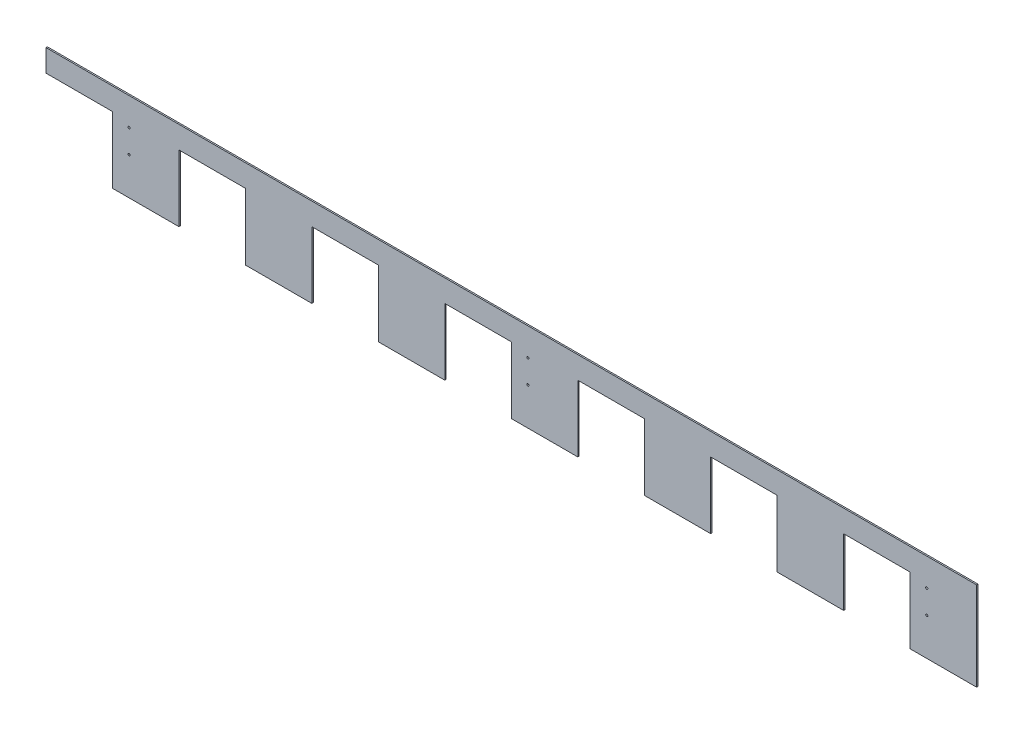
ISO-10303-21;
HEADER;
FILE_DESCRIPTION(('STEP AP214'),'2;1');
FILE_NAME('part.step','',(''),(''),'','','');
FILE_SCHEMA(('AUTOMOTIVE_DESIGN { 1 0 10303 214 1 1 1 1 }'));
ENDSEC;
DATA;
#1=APPLICATION_CONTEXT('core data for automotive mechanical design processes');
#2=APPLICATION_PROTOCOL_DEFINITION('international standard','automotive_design',2000,#1);
#3=PRODUCT_CONTEXT('',#1,'mechanical');
#4=PRODUCT('Part','Part','',(#3));
#5=PRODUCT_RELATED_PRODUCT_CATEGORY('part','',(#4));
#6=PRODUCT_DEFINITION_FORMATION('','',#4);
#7=PRODUCT_DEFINITION_CONTEXT('part definition',#1,'design');
#8=PRODUCT_DEFINITION('design','',#6,#7);
#9=PRODUCT_DEFINITION_SHAPE('','',#8);
#10=(LENGTH_UNIT() NAMED_UNIT(*) SI_UNIT(.MILLI.,.METRE.));
#11=(NAMED_UNIT(*) PLANE_ANGLE_UNIT() SI_UNIT($,.RADIAN.));
#12=(NAMED_UNIT(*) SI_UNIT($,.STERADIAN.) SOLID_ANGLE_UNIT());
#13=UNCERTAINTY_MEASURE_WITH_UNIT(LENGTH_MEASURE(1.E-05),#10,'distance_accuracy_value','');
#14=(GEOMETRIC_REPRESENTATION_CONTEXT(3) GLOBAL_UNCERTAINTY_ASSIGNED_CONTEXT((#13)) GLOBAL_UNIT_ASSIGNED_CONTEXT((#10,
#11,#12)) REPRESENTATION_CONTEXT('',''));
#15=CARTESIAN_POINT('',(0.,0.,0.));
#16=DIRECTION('',(0.,0.,1.));
#17=DIRECTION('',(1.,0.,0.));
#18=AXIS2_PLACEMENT_3D('',#15,#16,#17);
#19=CARTESIAN_POINT('',(0.,0.,3.175));
#20=DIRECTION('',(0.,0.,1.));
#21=DIRECTION('',(1.,0.,0.));
#22=AXIS2_PLACEMENT_3D('',#19,#20,#21);
#23=PLANE('',#22);
#24=CARTESIAN_POINT('',(-876.3,-15.875,3.175));
#25=DIRECTION('',(0.,0.,-1.));
#26=DIRECTION('',(-1.,0.,0.));
#27=AXIS2_PLACEMENT_3D('',#24,#25,#26);
#28=CIRCLE('',#27,2.4384);
#29=CARTESIAN_POINT('',(-878.7384,-15.875,3.175));
#30=VERTEX_POINT('',#29);
#31=EDGE_CURVE('E253',#30,#30,#28,.T.);
#32=ORIENTED_EDGE('',*,*,#31,.T.);
#33=EDGE_LOOP('',(#32));
#34=FACE_BOUND('',#33,.T.);
#35=CARTESIAN_POINT('',(-876.3,38.1,3.175));
#36=DIRECTION('',(0.,0.,-1.));
#37=DIRECTION('',(-1.,0.,0.));
#38=AXIS2_PLACEMENT_3D('',#35,#36,#37);
#39=CIRCLE('',#38,2.4384);
#40=CARTESIAN_POINT('',(-878.7384,38.1,3.175));
#41=VERTEX_POINT('',#40);
#42=EDGE_CURVE('E256',#41,#41,#39,.T.);
#43=ORIENTED_EDGE('',*,*,#42,.T.);
#44=EDGE_LOOP('',(#43));
#45=FACE_BOUND('',#44,.T.);
#46=CARTESIAN_POINT('',(38.1,-15.875,3.175));
#47=DIRECTION('',(0.,0.,-1.));
#48=DIRECTION('',(-1.,0.,0.));
#49=AXIS2_PLACEMENT_3D('',#46,#47,#48);
#50=CIRCLE('',#49,2.4384);
#51=CARTESIAN_POINT('',(35.6616,-15.875,3.175));
#52=VERTEX_POINT('',#51);
#53=EDGE_CURVE('E259',#52,#52,#50,.T.);
#54=ORIENTED_EDGE('',*,*,#53,.T.);
#55=EDGE_LOOP('',(#54));
#56=FACE_BOUND('',#55,.T.);
#57=CARTESIAN_POINT('',(38.1,38.1,3.175));
#58=DIRECTION('',(0.,0.,-1.));
#59=DIRECTION('',(-1.,0.,0.));
#60=AXIS2_PLACEMENT_3D('',#57,#58,#59);
#61=CIRCLE('',#60,2.4384);
#62=CARTESIAN_POINT('',(35.6616,38.1,3.175));
#63=VERTEX_POINT('',#62);
#64=EDGE_CURVE('E262',#63,#63,#61,.T.);
#65=ORIENTED_EDGE('',*,*,#64,.T.);
#66=EDGE_LOOP('',(#65));
#67=FACE_BOUND('',#66,.T.);
#68=CARTESIAN_POINT('',(952.5,-15.875,3.175));
#69=DIRECTION('',(0.,0.,-1.));
#70=DIRECTION('',(-1.,0.,0.));
#71=AXIS2_PLACEMENT_3D('',#68,#69,#70);
#72=CIRCLE('',#71,2.4384);
#73=CARTESIAN_POINT('',(950.0616,-15.875,3.175));
#74=VERTEX_POINT('',#73);
#75=EDGE_CURVE('E264',#74,#74,#72,.T.);
#76=ORIENTED_EDGE('',*,*,#75,.T.);
#77=EDGE_LOOP('',(#76));
#78=FACE_BOUND('',#77,.T.);
#79=CARTESIAN_POINT('',(952.5,38.1,3.175));
#80=DIRECTION('',(0.,0.,-1.));
#81=DIRECTION('',(-1.,0.,0.));
#82=AXIS2_PLACEMENT_3D('',#79,#80,#81);
#83=CIRCLE('',#82,2.4384);
#84=CARTESIAN_POINT('',(950.0616,38.1,3.175));
#85=VERTEX_POINT('',#84);
#86=EDGE_CURVE('E20',#85,#85,#83,.T.);
#87=ORIENTED_EDGE('',*,*,#86,.T.);
#88=EDGE_LOOP('',(#87));
#89=FACE_BOUND('',#88,.T.);
#90=DIRECTION('',(1.,0.,0.));
#91=VECTOR('',#90,1.);
#92=CARTESIAN_POINT('',(-914.4,50.8,3.175));
#93=LINE('',#92,#91);
#94=CARTESIAN_POINT('',(-1066.8,50.8,3.175));
#95=VERTEX_POINT('',#94);
#96=CARTESIAN_POINT('',(-914.4,50.8,3.175));
#97=VERTEX_POINT('',#96);
#98=EDGE_CURVE('E225',#95,#97,#93,.T.);
#99=ORIENTED_EDGE('',*,*,#98,.T.);
#100=DIRECTION('',(0.,1.,0.));
#101=VECTOR('',#100,1.);
#102=CARTESIAN_POINT('',(-914.4,-101.6,3.175));
#103=LINE('',#102,#101);
#104=CARTESIAN_POINT('',(-914.4,-101.6,3.175));
#105=VERTEX_POINT('',#104);
#106=EDGE_CURVE('E222',#97,#105,#103,.F.);
#107=ORIENTED_EDGE('',*,*,#106,.T.);
#108=DIRECTION('',(1.,0.,0.));
#109=VECTOR('',#108,1.);
#110=CARTESIAN_POINT('',(-1066.8,-101.6,3.175));
#111=LINE('',#110,#109);
#112=CARTESIAN_POINT('',(-762.,-101.6,3.175));
#113=VERTEX_POINT('',#112);
#114=EDGE_CURVE('E212',#113,#105,#111,.F.);
#115=ORIENTED_EDGE('',*,*,#114,.F.);
#116=DIRECTION('',(0.,1.,0.));
#117=VECTOR('',#116,1.);
#118=CARTESIAN_POINT('',(-762.,50.8,3.175));
#119=LINE('',#118,#117);
#120=CARTESIAN_POINT('',(-762.,50.8,3.175));
#121=VERTEX_POINT('',#120);
#122=EDGE_CURVE('E234',#113,#121,#119,.T.);
#123=ORIENTED_EDGE('',*,*,#122,.T.);
#124=DIRECTION('',(1.,0.,0.));
#125=VECTOR('',#124,1.);
#126=CARTESIAN_POINT('',(-609.6,50.8,3.175));
#127=LINE('',#126,#125);
#128=CARTESIAN_POINT('',(-609.6,50.8,3.175));
#129=VERTEX_POINT('',#128);
#130=EDGE_CURVE('E400',#121,#129,#127,.T.);
#131=ORIENTED_EDGE('',*,*,#130,.T.);
#132=DIRECTION('',(0.,1.,0.));
#133=VECTOR('',#132,1.);
#134=CARTESIAN_POINT('',(-609.6,-101.6,3.175));
#135=LINE('',#134,#133);
#136=CARTESIAN_POINT('',(-609.6,-101.6,3.175));
#137=VERTEX_POINT('',#136);
#138=EDGE_CURVE('E394',#129,#137,#135,.F.);
#139=ORIENTED_EDGE('',*,*,#138,.T.);
#140=DIRECTION('',(1.,0.,0.));
#141=VECTOR('',#140,1.);
#142=CARTESIAN_POINT('',(-1066.8,-101.6,3.175));
#143=LINE('',#142,#141);
#144=CARTESIAN_POINT('',(-457.2,-101.6,3.175));
#145=VERTEX_POINT('',#144);
#146=EDGE_CURVE('E392',#145,#137,#143,.F.);
#147=ORIENTED_EDGE('',*,*,#146,.F.);
#148=DIRECTION('',(0.,1.,0.));
#149=VECTOR('',#148,1.);
#150=CARTESIAN_POINT('',(-457.2,50.8,3.175));
#151=LINE('',#150,#149);
#152=CARTESIAN_POINT('',(-457.2,50.8,3.175));
#153=VERTEX_POINT('',#152);
#154=EDGE_CURVE('E385',#145,#153,#151,.T.);
#155=ORIENTED_EDGE('',*,*,#154,.T.);
#156=DIRECTION('',(1.,0.,0.));
#157=VECTOR('',#156,1.);
#158=CARTESIAN_POINT('',(-304.8,50.8,3.175));
#159=LINE('',#158,#157);
#160=CARTESIAN_POINT('',(-304.8,50.8,3.175));
#161=VERTEX_POINT('',#160);
#162=EDGE_CURVE('E380',#153,#161,#159,.T.);
#163=ORIENTED_EDGE('',*,*,#162,.T.);
#164=DIRECTION('',(0.,1.,0.));
#165=VECTOR('',#164,1.);
#166=CARTESIAN_POINT('',(-304.8,-101.6,3.175));
#167=LINE('',#166,#165);
#168=CARTESIAN_POINT('',(-304.8,-101.6,3.175));
#169=VERTEX_POINT('',#168);
#170=EDGE_CURVE('E374',#161,#169,#167,.F.);
#171=ORIENTED_EDGE('',*,*,#170,.T.);
#172=DIRECTION('',(1.,0.,0.));
#173=VECTOR('',#172,1.);
#174=CARTESIAN_POINT('',(-1066.8,-101.6,3.175));
#175=LINE('',#174,#173);
#176=CARTESIAN_POINT('',(-152.4,-101.6,3.175));
#177=VERTEX_POINT('',#176);
#178=EDGE_CURVE('E372',#177,#169,#175,.F.);
#179=ORIENTED_EDGE('',*,*,#178,.F.);
#180=DIRECTION('',(0.,1.,0.));
#181=VECTOR('',#180,1.);
#182=CARTESIAN_POINT('',(-152.4,50.8,3.175));
#183=LINE('',#182,#181);
#184=CARTESIAN_POINT('',(-152.4,50.8,3.175));
#185=VERTEX_POINT('',#184);
#186=EDGE_CURVE('E365',#177,#185,#183,.T.);
#187=ORIENTED_EDGE('',*,*,#186,.T.);
#188=DIRECTION('',(1.,0.,0.));
#189=VECTOR('',#188,1.);
#190=CARTESIAN_POINT('',(0.,50.8,3.175));
#191=LINE('',#190,#189);
#192=CARTESIAN_POINT('',(0.,50.8,3.175));
#193=VERTEX_POINT('',#192);
#194=EDGE_CURVE('E360',#185,#193,#191,.T.);
#195=ORIENTED_EDGE('',*,*,#194,.T.);
#196=DIRECTION('',(0.,1.,0.));
#197=VECTOR('',#196,1.);
#198=CARTESIAN_POINT('',(0.,-101.6,3.175));
#199=LINE('',#198,#197);
#200=CARTESIAN_POINT('',(0.,-101.6,3.175));
#201=VERTEX_POINT('',#200);
#202=EDGE_CURVE('E354',#193,#201,#199,.F.);
#203=ORIENTED_EDGE('',*,*,#202,.T.);
#204=DIRECTION('',(1.,0.,0.));
#205=VECTOR('',#204,1.);
#206=CARTESIAN_POINT('',(-1066.8,-101.6,3.175));
#207=LINE('',#206,#205);
#208=CARTESIAN_POINT('',(152.4,-101.6,3.175));
#209=VERTEX_POINT('',#208);
#210=EDGE_CURVE('E352',#209,#201,#207,.F.);
#211=ORIENTED_EDGE('',*,*,#210,.F.);
#212=DIRECTION('',(0.,1.,0.));
#213=VECTOR('',#212,1.);
#214=CARTESIAN_POINT('',(152.4,50.8,3.175));
#215=LINE('',#214,#213);
#216=CARTESIAN_POINT('',(152.4,50.8,3.175));
#217=VERTEX_POINT('',#216);
#218=EDGE_CURVE('E345',#209,#217,#215,.T.);
#219=ORIENTED_EDGE('',*,*,#218,.T.);
#220=DIRECTION('',(1.,0.,0.));
#221=VECTOR('',#220,1.);
#222=CARTESIAN_POINT('',(304.8,50.8,3.175));
#223=LINE('',#222,#221);
#224=CARTESIAN_POINT('',(304.8,50.8,3.175));
#225=VERTEX_POINT('',#224);
#226=EDGE_CURVE('E340',#217,#225,#223,.T.);
#227=ORIENTED_EDGE('',*,*,#226,.T.);
#228=DIRECTION('',(0.,1.,0.));
#229=VECTOR('',#228,1.);
#230=CARTESIAN_POINT('',(304.8,-101.6,3.175));
#231=LINE('',#230,#229);
#232=CARTESIAN_POINT('',(304.8,-101.6,3.175));
#233=VERTEX_POINT('',#232);
#234=EDGE_CURVE('E334',#225,#233,#231,.F.);
#235=ORIENTED_EDGE('',*,*,#234,.T.);
#236=DIRECTION('',(1.,0.,0.));
#237=VECTOR('',#236,1.);
#238=CARTESIAN_POINT('',(-1066.8,-101.6,3.175));
#239=LINE('',#238,#237);
#240=CARTESIAN_POINT('',(457.2,-101.6,3.175));
#241=VERTEX_POINT('',#240);
#242=EDGE_CURVE('E332',#241,#233,#239,.F.);
#243=ORIENTED_EDGE('',*,*,#242,.F.);
#244=DIRECTION('',(0.,1.,0.));
#245=VECTOR('',#244,1.);
#246=CARTESIAN_POINT('',(457.2,50.8,3.175));
#247=LINE('',#246,#245);
#248=CARTESIAN_POINT('',(457.2,50.8,3.175));
#249=VERTEX_POINT('',#248);
#250=EDGE_CURVE('E325',#241,#249,#247,.T.);
#251=ORIENTED_EDGE('',*,*,#250,.T.);
#252=DIRECTION('',(1.,0.,0.));
#253=VECTOR('',#252,1.);
#254=CARTESIAN_POINT('',(609.6,50.8,3.175));
#255=LINE('',#254,#253);
#256=CARTESIAN_POINT('',(609.6,50.8,3.175));
#257=VERTEX_POINT('',#256);
#258=EDGE_CURVE('E320',#249,#257,#255,.T.);
#259=ORIENTED_EDGE('',*,*,#258,.T.);
#260=DIRECTION('',(0.,1.,0.));
#261=VECTOR('',#260,1.);
#262=CARTESIAN_POINT('',(609.6,-101.6,3.175));
#263=LINE('',#262,#261);
#264=CARTESIAN_POINT('',(609.6,-101.6,3.175));
#265=VERTEX_POINT('',#264);
#266=EDGE_CURVE('E314',#257,#265,#263,.F.);
#267=ORIENTED_EDGE('',*,*,#266,.T.);
#268=DIRECTION('',(1.,0.,0.));
#269=VECTOR('',#268,1.);
#270=CARTESIAN_POINT('',(-1066.8,-101.6,3.175));
#271=LINE('',#270,#269);
#272=CARTESIAN_POINT('',(762.,-101.6,3.175));
#273=VERTEX_POINT('',#272);
#274=EDGE_CURVE('E312',#273,#265,#271,.F.);
#275=ORIENTED_EDGE('',*,*,#274,.F.);
#276=DIRECTION('',(0.,1.,0.));
#277=VECTOR('',#276,1.);
#278=CARTESIAN_POINT('',(762.,50.8,3.175));
#279=LINE('',#278,#277);
#280=CARTESIAN_POINT('',(762.,50.8,3.175));
#281=VERTEX_POINT('',#280);
#282=EDGE_CURVE('E305',#273,#281,#279,.T.);
#283=ORIENTED_EDGE('',*,*,#282,.T.);
#284=DIRECTION('',(1.,0.,0.));
#285=VECTOR('',#284,1.);
#286=CARTESIAN_POINT('',(914.4,50.8,3.175));
#287=LINE('',#286,#285);
#288=CARTESIAN_POINT('',(914.4,50.8,3.175));
#289=VERTEX_POINT('',#288);
#290=EDGE_CURVE('E300',#281,#289,#287,.T.);
#291=ORIENTED_EDGE('',*,*,#290,.T.);
#292=DIRECTION('',(0.,1.,0.));
#293=VECTOR('',#292,1.);
#294=CARTESIAN_POINT('',(914.4,-101.6,3.175));
#295=LINE('',#294,#293);
#296=CARTESIAN_POINT('',(914.4,-101.6,3.175));
#297=VERTEX_POINT('',#296);
#298=EDGE_CURVE('E294',#289,#297,#295,.F.);
#299=ORIENTED_EDGE('',*,*,#298,.T.);
#300=DIRECTION('',(1.,0.,0.));
#301=VECTOR('',#300,1.);
#302=CARTESIAN_POINT('',(-1066.8,-101.6,3.175));
#303=LINE('',#302,#301);
#304=CARTESIAN_POINT('',(1066.8,-101.6,3.175));
#305=VERTEX_POINT('',#304);
#306=EDGE_CURVE('E292',#305,#297,#303,.F.);
#307=ORIENTED_EDGE('',*,*,#306,.F.);
#308=DIRECTION('',(0.,1.,0.));
#309=VECTOR('',#308,1.);
#310=CARTESIAN_POINT('',(1066.8,-101.6,3.175));
#311=LINE('',#310,#309);
#312=CARTESIAN_POINT('',(1066.8,101.6,3.175));
#313=VERTEX_POINT('',#312);
#314=EDGE_CURVE('E288',#313,#305,#311,.F.);
#315=ORIENTED_EDGE('',*,*,#314,.F.);
#316=DIRECTION('',(1.,0.,0.));
#317=VECTOR('',#316,1.);
#318=CARTESIAN_POINT('',(1066.8,101.6,3.175));
#319=LINE('',#318,#317);
#320=CARTESIAN_POINT('',(-1066.8,101.6,3.175));
#321=VERTEX_POINT('',#320);
#322=EDGE_CURVE('E284',#321,#313,#319,.T.);
#323=ORIENTED_EDGE('',*,*,#322,.F.);
#324=DIRECTION('',(0.,1.,0.));
#325=VECTOR('',#324,1.);
#326=CARTESIAN_POINT('',(-1066.8,101.6,3.175));
#327=LINE('',#326,#325);
#328=EDGE_CURVE('E280',#95,#321,#327,.T.);
#329=ORIENTED_EDGE('',*,*,#328,.F.);
#330=EDGE_LOOP('',(#99,#107,#115,#123,#131,#139,#147,#155,#163,#171,#179,#187,#195,#203,#211,
#219,#227,#235,#243,#251,#259,#267,#275,#283,#291,#299,#307,#315,#323,#329));
#331=FACE_BOUND('',#330,.T.);
#332=ADVANCED_FACE('F17',(#34,#45,#56,#67,#78,#89,#331),#23,.T.);
#333=CARTESIAN_POINT('',(-914.4,-101.6,3.175));
#334=DIRECTION('',(1.,0.,0.));
#335=DIRECTION('',(0.,0.,-1.));
#336=AXIS2_PLACEMENT_3D('',#333,#334,#335);
#337=PLANE('',#336);
#338=ORIENTED_EDGE('',*,*,#106,.F.);
#339=DIRECTION('',(0.,0.,1.));
#340=VECTOR('',#339,1.);
#341=CARTESIAN_POINT('',(-914.4,50.8,3.175));
#342=LINE('',#341,#340);
#343=CARTESIAN_POINT('',(-914.4,50.8,0.));
#344=VERTEX_POINT('',#343);
#345=EDGE_CURVE('E269',#97,#344,#342,.F.);
#346=ORIENTED_EDGE('',*,*,#345,.T.);
#347=DIRECTION('',(0.,1.,0.));
#348=VECTOR('',#347,1.);
#349=CARTESIAN_POINT('',(-914.4,0.,0.));
#350=LINE('',#349,#348);
#351=CARTESIAN_POINT('',(-914.4,-101.6,0.));
#352=VERTEX_POINT('',#351);
#353=EDGE_CURVE('E232',#344,#352,#350,.F.);
#354=ORIENTED_EDGE('',*,*,#353,.T.);
#355=DIRECTION('',(0.,0.,-1.));
#356=VECTOR('',#355,1.);
#357=CARTESIAN_POINT('',(-914.4,-101.6,0.));
#358=LINE('',#357,#356);
#359=EDGE_CURVE('E219',#105,#352,#358,.T.);
#360=ORIENTED_EDGE('',*,*,#359,.F.);
#361=EDGE_LOOP('',(#338,#346,#354,#360));
#362=FACE_BOUND('',#361,.T.);
#363=ADVANCED_FACE('F231',(#362),#337,.F.);
#364=CARTESIAN_POINT('',(-1066.8,-101.6,0.));
#365=DIRECTION('',(0.,-1.,0.));
#366=DIRECTION('',(0.,0.,-1.));
#367=AXIS2_PLACEMENT_3D('',#364,#365,#366);
#368=PLANE('',#367);
#369=ORIENTED_EDGE('',*,*,#114,.T.);
#370=ORIENTED_EDGE('',*,*,#359,.T.);
#371=DIRECTION('',(1.,0.,0.));
#372=VECTOR('',#371,1.);
#373=CARTESIAN_POINT('',(0.,-101.6,0.));
#374=LINE('',#373,#372);
#375=CARTESIAN_POINT('',(-762.,-101.6,0.));
#376=VERTEX_POINT('',#375);
#377=EDGE_CURVE('E417',#352,#376,#374,.T.);
#378=ORIENTED_EDGE('',*,*,#377,.T.);
#379=DIRECTION('',(0.,0.,1.));
#380=VECTOR('',#379,1.);
#381=CARTESIAN_POINT('',(-762.,-101.6,3.175));
#382=LINE('',#381,#380);
#383=EDGE_CURVE('E221',#376,#113,#382,.T.);
#384=ORIENTED_EDGE('',*,*,#383,.T.);
#385=EDGE_LOOP('',(#369,#370,#378,#384));
#386=FACE_BOUND('',#385,.T.);
#387=ADVANCED_FACE('F216',(#386),#368,.T.);
#388=CARTESIAN_POINT('',(-762.,50.8,3.175));
#389=DIRECTION('',(-1.,0.,0.));
#390=DIRECTION('',(0.,0.,1.));
#391=AXIS2_PLACEMENT_3D('',#388,#389,#390);
#392=PLANE('',#391);
#393=ORIENTED_EDGE('',*,*,#122,.F.);
#394=ORIENTED_EDGE('',*,*,#383,.F.);
#395=DIRECTION('',(0.,1.,0.));
#396=VECTOR('',#395,1.);
#397=CARTESIAN_POINT('',(-762.,0.,0.));
#398=LINE('',#397,#396);
#399=CARTESIAN_POINT('',(-762.,50.8,0.));
#400=VERTEX_POINT('',#399);
#401=EDGE_CURVE('E414',#376,#400,#398,.T.);
#402=ORIENTED_EDGE('',*,*,#401,.T.);
#403=DIRECTION('',(0.,0.,1.));
#404=VECTOR('',#403,1.);
#405=CARTESIAN_POINT('',(-762.,50.8,3.175));
#406=LINE('',#405,#404);
#407=EDGE_CURVE('E402',#400,#121,#406,.T.);
#408=ORIENTED_EDGE('',*,*,#407,.T.);
#409=EDGE_LOOP('',(#393,#394,#402,#408));
#410=FACE_BOUND('',#409,.T.);
#411=ADVANCED_FACE('F412',(#410),#392,.F.);
#412=CARTESIAN_POINT('',(-609.6,50.8,3.175));
#413=DIRECTION('',(0.,1.,0.));
#414=DIRECTION('',(0.,0.,1.));
#415=AXIS2_PLACEMENT_3D('',#412,#413,#414);
#416=PLANE('',#415);
#417=ORIENTED_EDGE('',*,*,#130,.F.);
#418=ORIENTED_EDGE('',*,*,#407,.F.);
#419=DIRECTION('',(1.,0.,0.));
#420=VECTOR('',#419,1.);
#421=CARTESIAN_POINT('',(0.,50.8,0.));
#422=LINE('',#421,#420);
#423=CARTESIAN_POINT('',(-609.6,50.8,0.));
#424=VERTEX_POINT('',#423);
#425=EDGE_CURVE('E416',#400,#424,#422,.T.);
#426=ORIENTED_EDGE('',*,*,#425,.T.);
#427=DIRECTION('',(0.,0.,-1.));
#428=VECTOR('',#427,1.);
#429=CARTESIAN_POINT('',(-609.6,50.8,3.175));
#430=LINE('',#429,#428);
#431=EDGE_CURVE('E397',#424,#129,#430,.F.);
#432=ORIENTED_EDGE('',*,*,#431,.T.);
#433=EDGE_LOOP('',(#417,#418,#426,#432));
#434=FACE_BOUND('',#433,.T.);
#435=ADVANCED_FACE('F408',(#434),#416,.F.);
#436=CARTESIAN_POINT('',(-609.6,-101.6,3.175));
#437=DIRECTION('',(1.,0.,0.));
#438=DIRECTION('',(0.,0.,-1.));
#439=AXIS2_PLACEMENT_3D('',#436,#437,#438);
#440=PLANE('',#439);
#441=ORIENTED_EDGE('',*,*,#138,.F.);
#442=ORIENTED_EDGE('',*,*,#431,.F.);
#443=DIRECTION('',(0.,1.,0.));
#444=VECTOR('',#443,1.);
#445=CARTESIAN_POINT('',(-609.6,0.,0.));
#446=LINE('',#445,#444);
#447=CARTESIAN_POINT('',(-609.6,-101.6,0.));
#448=VERTEX_POINT('',#447);
#449=EDGE_CURVE('E419',#424,#448,#446,.F.);
#450=ORIENTED_EDGE('',*,*,#449,.T.);
#451=DIRECTION('',(0.,0.,-1.));
#452=VECTOR('',#451,1.);
#453=CARTESIAN_POINT('',(-609.6,-101.6,0.));
#454=LINE('',#453,#452);
#455=EDGE_CURVE('E390',#137,#448,#454,.T.);
#456=ORIENTED_EDGE('',*,*,#455,.F.);
#457=EDGE_LOOP('',(#441,#442,#450,#456));
#458=FACE_BOUND('',#457,.T.);
#459=ADVANCED_FACE('F599',(#458),#440,.F.);
#460=CARTESIAN_POINT('',(-1066.8,-101.6,0.));
#461=DIRECTION('',(0.,-1.,0.));
#462=DIRECTION('',(0.,0.,-1.));
#463=AXIS2_PLACEMENT_3D('',#460,#461,#462);
#464=PLANE('',#463);
#465=ORIENTED_EDGE('',*,*,#146,.T.);
#466=ORIENTED_EDGE('',*,*,#455,.T.);
#467=DIRECTION('',(1.,0.,0.));
#468=VECTOR('',#467,1.);
#469=CARTESIAN_POINT('',(0.,-101.6,0.));
#470=LINE('',#469,#468);
#471=CARTESIAN_POINT('',(-457.2,-101.6,0.));
#472=VERTEX_POINT('',#471);
#473=EDGE_CURVE('E424',#448,#472,#470,.T.);
#474=ORIENTED_EDGE('',*,*,#473,.T.);
#475=DIRECTION('',(0.,0.,1.));
#476=VECTOR('',#475,1.);
#477=CARTESIAN_POINT('',(-457.2,-101.6,3.175));
#478=LINE('',#477,#476);
#479=EDGE_CURVE('E387',#472,#145,#478,.T.);
#480=ORIENTED_EDGE('',*,*,#479,.T.);
#481=EDGE_LOOP('',(#465,#466,#474,#480));
#482=FACE_BOUND('',#481,.T.);
#483=ADVANCED_FACE('F595',(#482),#464,.T.);
#484=CARTESIAN_POINT('',(-457.2,50.8,3.175));
#485=DIRECTION('',(-1.,0.,0.));
#486=DIRECTION('',(0.,0.,1.));
#487=AXIS2_PLACEMENT_3D('',#484,#485,#486);
#488=PLANE('',#487);
#489=ORIENTED_EDGE('',*,*,#154,.F.);
#490=ORIENTED_EDGE('',*,*,#479,.F.);
#491=DIRECTION('',(0.,1.,0.));
#492=VECTOR('',#491,1.);
#493=CARTESIAN_POINT('',(-457.2,0.,0.));
#494=LINE('',#493,#492);
#495=CARTESIAN_POINT('',(-457.2,50.8,0.));
#496=VERTEX_POINT('',#495);
#497=EDGE_CURVE('E427',#472,#496,#494,.T.);
#498=ORIENTED_EDGE('',*,*,#497,.T.);
#499=DIRECTION('',(0.,0.,1.));
#500=VECTOR('',#499,1.);
#501=CARTESIAN_POINT('',(-457.2,50.8,3.175));
#502=LINE('',#501,#500);
#503=EDGE_CURVE('E382',#496,#153,#502,.T.);
#504=ORIENTED_EDGE('',*,*,#503,.T.);
#505=EDGE_LOOP('',(#489,#490,#498,#504));
#506=FACE_BOUND('',#505,.T.);
#507=ADVANCED_FACE('F593',(#506),#488,.F.);
#508=CARTESIAN_POINT('',(-304.8,50.8,3.175));
#509=DIRECTION('',(0.,1.,0.));
#510=DIRECTION('',(0.,0.,1.));
#511=AXIS2_PLACEMENT_3D('',#508,#509,#510);
#512=PLANE('',#511);
#513=ORIENTED_EDGE('',*,*,#162,.F.);
#514=ORIENTED_EDGE('',*,*,#503,.F.);
#515=DIRECTION('',(1.,0.,0.));
#516=VECTOR('',#515,1.);
#517=CARTESIAN_POINT('',(0.,50.8,0.));
#518=LINE('',#517,#516);
#519=CARTESIAN_POINT('',(-304.8,50.8,0.));
#520=VERTEX_POINT('',#519);
#521=EDGE_CURVE('E430',#496,#520,#518,.T.);
#522=ORIENTED_EDGE('',*,*,#521,.T.);
#523=DIRECTION('',(0.,0.,-1.));
#524=VECTOR('',#523,1.);
#525=CARTESIAN_POINT('',(-304.8,50.8,3.175));
#526=LINE('',#525,#524);
#527=EDGE_CURVE('E377',#520,#161,#526,.F.);
#528=ORIENTED_EDGE('',*,*,#527,.T.);
#529=EDGE_LOOP('',(#513,#514,#522,#528));
#530=FACE_BOUND('',#529,.T.);
#531=ADVANCED_FACE('F588',(#530),#512,.F.);
#532=CARTESIAN_POINT('',(-304.8,-101.6,3.175));
#533=DIRECTION('',(1.,0.,0.));
#534=DIRECTION('',(0.,0.,-1.));
#535=AXIS2_PLACEMENT_3D('',#532,#533,#534);
#536=PLANE('',#535);
#537=ORIENTED_EDGE('',*,*,#170,.F.);
#538=ORIENTED_EDGE('',*,*,#527,.F.);
#539=DIRECTION('',(0.,1.,0.));
#540=VECTOR('',#539,1.);
#541=CARTESIAN_POINT('',(-304.8,0.,0.));
#542=LINE('',#541,#540);
#543=CARTESIAN_POINT('',(-304.8,-101.6,0.));
#544=VERTEX_POINT('',#543);
#545=EDGE_CURVE('E433',#520,#544,#542,.F.);
#546=ORIENTED_EDGE('',*,*,#545,.T.);
#547=DIRECTION('',(0.,0.,-1.));
#548=VECTOR('',#547,1.);
#549=CARTESIAN_POINT('',(-304.8,-101.6,0.));
#550=LINE('',#549,#548);
#551=EDGE_CURVE('E370',#169,#544,#550,.T.);
#552=ORIENTED_EDGE('',*,*,#551,.F.);
#553=EDGE_LOOP('',(#537,#538,#546,#552));
#554=FACE_BOUND('',#553,.T.);
#555=ADVANCED_FACE('F585',(#554),#536,.F.);
#556=CARTESIAN_POINT('',(-1066.8,-101.6,0.));
#557=DIRECTION('',(0.,-1.,0.));
#558=DIRECTION('',(0.,0.,-1.));
#559=AXIS2_PLACEMENT_3D('',#556,#557,#558);
#560=PLANE('',#559);
#561=ORIENTED_EDGE('',*,*,#178,.T.);
#562=ORIENTED_EDGE('',*,*,#551,.T.);
#563=DIRECTION('',(1.,0.,0.));
#564=VECTOR('',#563,1.);
#565=CARTESIAN_POINT('',(0.,-101.6,0.));
#566=LINE('',#565,#564);
#567=CARTESIAN_POINT('',(-152.4,-101.6,0.));
#568=VERTEX_POINT('',#567);
#569=EDGE_CURVE('E436',#544,#568,#566,.T.);
#570=ORIENTED_EDGE('',*,*,#569,.T.);
#571=DIRECTION('',(0.,0.,1.));
#572=VECTOR('',#571,1.);
#573=CARTESIAN_POINT('',(-152.4,-101.6,3.175));
#574=LINE('',#573,#572);
#575=EDGE_CURVE('E367',#568,#177,#574,.T.);
#576=ORIENTED_EDGE('',*,*,#575,.T.);
#577=EDGE_LOOP('',(#561,#562,#570,#576));
#578=FACE_BOUND('',#577,.T.);
#579=ADVANCED_FACE('F579',(#578),#560,.T.);
#580=CARTESIAN_POINT('',(-152.4,50.8,3.175));
#581=DIRECTION('',(-1.,0.,0.));
#582=DIRECTION('',(0.,0.,1.));
#583=AXIS2_PLACEMENT_3D('',#580,#581,#582);
#584=PLANE('',#583);
#585=ORIENTED_EDGE('',*,*,#186,.F.);
#586=ORIENTED_EDGE('',*,*,#575,.F.);
#587=DIRECTION('',(0.,1.,0.));
#588=VECTOR('',#587,1.);
#589=CARTESIAN_POINT('',(-152.4,0.,0.));
#590=LINE('',#589,#588);
#591=CARTESIAN_POINT('',(-152.4,50.8,0.));
#592=VERTEX_POINT('',#591);
#593=EDGE_CURVE('E439',#568,#592,#590,.T.);
#594=ORIENTED_EDGE('',*,*,#593,.T.);
#595=DIRECTION('',(0.,0.,1.));
#596=VECTOR('',#595,1.);
#597=CARTESIAN_POINT('',(-152.4,50.8,3.175));
#598=LINE('',#597,#596);
#599=EDGE_CURVE('E362',#592,#185,#598,.T.);
#600=ORIENTED_EDGE('',*,*,#599,.T.);
#601=EDGE_LOOP('',(#585,#586,#594,#600));
#602=FACE_BOUND('',#601,.T.);
#603=ADVANCED_FACE('F577',(#602),#584,.F.);
#604=CARTESIAN_POINT('',(0.,50.8,3.175));
#605=DIRECTION('',(0.,1.,0.));
#606=DIRECTION('',(0.,0.,1.));
#607=AXIS2_PLACEMENT_3D('',#604,#605,#606);
#608=PLANE('',#607);
#609=ORIENTED_EDGE('',*,*,#194,.F.);
#610=ORIENTED_EDGE('',*,*,#599,.F.);
#611=DIRECTION('',(1.,0.,0.));
#612=VECTOR('',#611,1.);
#613=CARTESIAN_POINT('',(0.,50.8,0.));
#614=LINE('',#613,#612);
#615=CARTESIAN_POINT('',(0.,50.8,0.));
#616=VERTEX_POINT('',#615);
#617=EDGE_CURVE('E442',#592,#616,#614,.T.);
#618=ORIENTED_EDGE('',*,*,#617,.T.);
#619=DIRECTION('',(0.,0.,-1.));
#620=VECTOR('',#619,1.);
#621=CARTESIAN_POINT('',(0.,50.8,3.175));
#622=LINE('',#621,#620);
#623=EDGE_CURVE('E357',#616,#193,#622,.F.);
#624=ORIENTED_EDGE('',*,*,#623,.T.);
#625=EDGE_LOOP('',(#609,#610,#618,#624));
#626=FACE_BOUND('',#625,.T.);
#627=ADVANCED_FACE('F572',(#626),#608,.F.);
#628=CARTESIAN_POINT('',(0.,-101.6,3.175));
#629=DIRECTION('',(1.,0.,0.));
#630=DIRECTION('',(0.,0.,-1.));
#631=AXIS2_PLACEMENT_3D('',#628,#629,#630);
#632=PLANE('',#631);
#633=ORIENTED_EDGE('',*,*,#202,.F.);
#634=ORIENTED_EDGE('',*,*,#623,.F.);
#635=DIRECTION('',(0.,1.,0.));
#636=VECTOR('',#635,1.);
#637=CARTESIAN_POINT('',(0.,0.,0.));
#638=LINE('',#637,#636);
#639=CARTESIAN_POINT('',(0.,-101.6,0.));
#640=VERTEX_POINT('',#639);
#641=EDGE_CURVE('E445',#616,#640,#638,.F.);
#642=ORIENTED_EDGE('',*,*,#641,.T.);
#643=DIRECTION('',(0.,0.,-1.));
#644=VECTOR('',#643,1.);
#645=CARTESIAN_POINT('',(0.,-101.6,0.));
#646=LINE('',#645,#644);
#647=EDGE_CURVE('E350',#201,#640,#646,.T.);
#648=ORIENTED_EDGE('',*,*,#647,.F.);
#649=EDGE_LOOP('',(#633,#634,#642,#648));
#650=FACE_BOUND('',#649,.T.);
#651=ADVANCED_FACE('F569',(#650),#632,.F.);
#652=CARTESIAN_POINT('',(-1066.8,-101.6,0.));
#653=DIRECTION('',(0.,-1.,0.));
#654=DIRECTION('',(0.,0.,-1.));
#655=AXIS2_PLACEMENT_3D('',#652,#653,#654);
#656=PLANE('',#655);
#657=ORIENTED_EDGE('',*,*,#210,.T.);
#658=ORIENTED_EDGE('',*,*,#647,.T.);
#659=DIRECTION('',(1.,0.,0.));
#660=VECTOR('',#659,1.);
#661=CARTESIAN_POINT('',(0.,-101.6,0.));
#662=LINE('',#661,#660);
#663=CARTESIAN_POINT('',(152.4,-101.6,0.));
#664=VERTEX_POINT('',#663);
#665=EDGE_CURVE('E448',#640,#664,#662,.T.);
#666=ORIENTED_EDGE('',*,*,#665,.T.);
#667=DIRECTION('',(0.,0.,1.));
#668=VECTOR('',#667,1.);
#669=CARTESIAN_POINT('',(152.4,-101.6,3.175));
#670=LINE('',#669,#668);
#671=EDGE_CURVE('E347',#664,#209,#670,.T.);
#672=ORIENTED_EDGE('',*,*,#671,.T.);
#673=EDGE_LOOP('',(#657,#658,#666,#672));
#674=FACE_BOUND('',#673,.T.);
#675=ADVANCED_FACE('F563',(#674),#656,.T.);
#676=CARTESIAN_POINT('',(152.4,50.8,3.175));
#677=DIRECTION('',(-1.,0.,0.));
#678=DIRECTION('',(0.,0.,1.));
#679=AXIS2_PLACEMENT_3D('',#676,#677,#678);
#680=PLANE('',#679);
#681=ORIENTED_EDGE('',*,*,#218,.F.);
#682=ORIENTED_EDGE('',*,*,#671,.F.);
#683=DIRECTION('',(0.,1.,0.));
#684=VECTOR('',#683,1.);
#685=CARTESIAN_POINT('',(152.4,0.,0.));
#686=LINE('',#685,#684);
#687=CARTESIAN_POINT('',(152.4,50.8,0.));
#688=VERTEX_POINT('',#687);
#689=EDGE_CURVE('E451',#664,#688,#686,.T.);
#690=ORIENTED_EDGE('',*,*,#689,.T.);
#691=DIRECTION('',(0.,0.,1.));
#692=VECTOR('',#691,1.);
#693=CARTESIAN_POINT('',(152.4,50.8,3.175));
#694=LINE('',#693,#692);
#695=EDGE_CURVE('E342',#688,#217,#694,.T.);
#696=ORIENTED_EDGE('',*,*,#695,.T.);
#697=EDGE_LOOP('',(#681,#682,#690,#696));
#698=FACE_BOUND('',#697,.T.);
#699=ADVANCED_FACE('F561',(#698),#680,.F.);
#700=CARTESIAN_POINT('',(304.8,50.8,3.175));
#701=DIRECTION('',(0.,1.,0.));
#702=DIRECTION('',(0.,0.,1.));
#703=AXIS2_PLACEMENT_3D('',#700,#701,#702);
#704=PLANE('',#703);
#705=ORIENTED_EDGE('',*,*,#226,.F.);
#706=ORIENTED_EDGE('',*,*,#695,.F.);
#707=DIRECTION('',(1.,0.,0.));
#708=VECTOR('',#707,1.);
#709=CARTESIAN_POINT('',(0.,50.8,0.));
#710=LINE('',#709,#708);
#711=CARTESIAN_POINT('',(304.8,50.8,0.));
#712=VERTEX_POINT('',#711);
#713=EDGE_CURVE('E454',#688,#712,#710,.T.);
#714=ORIENTED_EDGE('',*,*,#713,.T.);
#715=DIRECTION('',(0.,0.,-1.));
#716=VECTOR('',#715,1.);
#717=CARTESIAN_POINT('',(304.8,50.8,3.175));
#718=LINE('',#717,#716);
#719=EDGE_CURVE('E337',#712,#225,#718,.F.);
#720=ORIENTED_EDGE('',*,*,#719,.T.);
#721=EDGE_LOOP('',(#705,#706,#714,#720));
#722=FACE_BOUND('',#721,.T.);
#723=ADVANCED_FACE('F556',(#722),#704,.F.);
#724=CARTESIAN_POINT('',(304.8,-101.6,3.175));
#725=DIRECTION('',(1.,0.,0.));
#726=DIRECTION('',(0.,0.,-1.));
#727=AXIS2_PLACEMENT_3D('',#724,#725,#726);
#728=PLANE('',#727);
#729=ORIENTED_EDGE('',*,*,#234,.F.);
#730=ORIENTED_EDGE('',*,*,#719,.F.);
#731=DIRECTION('',(0.,1.,0.));
#732=VECTOR('',#731,1.);
#733=CARTESIAN_POINT('',(304.8,0.,0.));
#734=LINE('',#733,#732);
#735=CARTESIAN_POINT('',(304.8,-101.6,0.));
#736=VERTEX_POINT('',#735);
#737=EDGE_CURVE('E457',#712,#736,#734,.F.);
#738=ORIENTED_EDGE('',*,*,#737,.T.);
#739=DIRECTION('',(0.,0.,-1.));
#740=VECTOR('',#739,1.);
#741=CARTESIAN_POINT('',(304.8,-101.6,0.));
#742=LINE('',#741,#740);
#743=EDGE_CURVE('E330',#233,#736,#742,.T.);
#744=ORIENTED_EDGE('',*,*,#743,.F.);
#745=EDGE_LOOP('',(#729,#730,#738,#744));
#746=FACE_BOUND('',#745,.T.);
#747=ADVANCED_FACE('F553',(#746),#728,.F.);
#748=CARTESIAN_POINT('',(-1066.8,-101.6,0.));
#749=DIRECTION('',(0.,-1.,0.));
#750=DIRECTION('',(0.,0.,-1.));
#751=AXIS2_PLACEMENT_3D('',#748,#749,#750);
#752=PLANE('',#751);
#753=ORIENTED_EDGE('',*,*,#242,.T.);
#754=ORIENTED_EDGE('',*,*,#743,.T.);
#755=DIRECTION('',(1.,0.,0.));
#756=VECTOR('',#755,1.);
#757=CARTESIAN_POINT('',(0.,-101.6,0.));
#758=LINE('',#757,#756);
#759=CARTESIAN_POINT('',(457.2,-101.6,0.));
#760=VERTEX_POINT('',#759);
#761=EDGE_CURVE('E460',#736,#760,#758,.T.);
#762=ORIENTED_EDGE('',*,*,#761,.T.);
#763=DIRECTION('',(0.,0.,1.));
#764=VECTOR('',#763,1.);
#765=CARTESIAN_POINT('',(457.2,-101.6,3.175));
#766=LINE('',#765,#764);
#767=EDGE_CURVE('E327',#760,#241,#766,.T.);
#768=ORIENTED_EDGE('',*,*,#767,.T.);
#769=EDGE_LOOP('',(#753,#754,#762,#768));
#770=FACE_BOUND('',#769,.T.);
#771=ADVANCED_FACE('F547',(#770),#752,.T.);
#772=CARTESIAN_POINT('',(457.2,50.8,3.175));
#773=DIRECTION('',(-1.,0.,0.));
#774=DIRECTION('',(0.,0.,1.));
#775=AXIS2_PLACEMENT_3D('',#772,#773,#774);
#776=PLANE('',#775);
#777=ORIENTED_EDGE('',*,*,#250,.F.);
#778=ORIENTED_EDGE('',*,*,#767,.F.);
#779=DIRECTION('',(0.,1.,0.));
#780=VECTOR('',#779,1.);
#781=CARTESIAN_POINT('',(457.2,0.,0.));
#782=LINE('',#781,#780);
#783=CARTESIAN_POINT('',(457.2,50.8,0.));
#784=VERTEX_POINT('',#783);
#785=EDGE_CURVE('E463',#760,#784,#782,.T.);
#786=ORIENTED_EDGE('',*,*,#785,.T.);
#787=DIRECTION('',(0.,0.,1.));
#788=VECTOR('',#787,1.);
#789=CARTESIAN_POINT('',(457.2,50.8,3.175));
#790=LINE('',#789,#788);
#791=EDGE_CURVE('E322',#784,#249,#790,.T.);
#792=ORIENTED_EDGE('',*,*,#791,.T.);
#793=EDGE_LOOP('',(#777,#778,#786,#792));
#794=FACE_BOUND('',#793,.T.);
#795=ADVANCED_FACE('F545',(#794),#776,.F.);
#796=CARTESIAN_POINT('',(609.6,50.8,3.175));
#797=DIRECTION('',(0.,1.,0.));
#798=DIRECTION('',(0.,0.,1.));
#799=AXIS2_PLACEMENT_3D('',#796,#797,#798);
#800=PLANE('',#799);
#801=ORIENTED_EDGE('',*,*,#258,.F.);
#802=ORIENTED_EDGE('',*,*,#791,.F.);
#803=DIRECTION('',(1.,0.,0.));
#804=VECTOR('',#803,1.);
#805=CARTESIAN_POINT('',(0.,50.8,0.));
#806=LINE('',#805,#804);
#807=CARTESIAN_POINT('',(609.6,50.8,0.));
#808=VERTEX_POINT('',#807);
#809=EDGE_CURVE('E466',#784,#808,#806,.T.);
#810=ORIENTED_EDGE('',*,*,#809,.T.);
#811=DIRECTION('',(0.,0.,-1.));
#812=VECTOR('',#811,1.);
#813=CARTESIAN_POINT('',(609.6,50.8,3.175));
#814=LINE('',#813,#812);
#815=EDGE_CURVE('E317',#808,#257,#814,.F.);
#816=ORIENTED_EDGE('',*,*,#815,.T.);
#817=EDGE_LOOP('',(#801,#802,#810,#816));
#818=FACE_BOUND('',#817,.T.);
#819=ADVANCED_FACE('F540',(#818),#800,.F.);
#820=CARTESIAN_POINT('',(609.6,-101.6,3.175));
#821=DIRECTION('',(1.,0.,0.));
#822=DIRECTION('',(0.,0.,-1.));
#823=AXIS2_PLACEMENT_3D('',#820,#821,#822);
#824=PLANE('',#823);
#825=ORIENTED_EDGE('',*,*,#266,.F.);
#826=ORIENTED_EDGE('',*,*,#815,.F.);
#827=DIRECTION('',(0.,1.,0.));
#828=VECTOR('',#827,1.);
#829=CARTESIAN_POINT('',(609.6,0.,0.));
#830=LINE('',#829,#828);
#831=CARTESIAN_POINT('',(609.6,-101.6,0.));
#832=VERTEX_POINT('',#831);
#833=EDGE_CURVE('E469',#808,#832,#830,.F.);
#834=ORIENTED_EDGE('',*,*,#833,.T.);
#835=DIRECTION('',(0.,0.,-1.));
#836=VECTOR('',#835,1.);
#837=CARTESIAN_POINT('',(609.6,-101.6,0.));
#838=LINE('',#837,#836);
#839=EDGE_CURVE('E310',#265,#832,#838,.T.);
#840=ORIENTED_EDGE('',*,*,#839,.F.);
#841=EDGE_LOOP('',(#825,#826,#834,#840));
#842=FACE_BOUND('',#841,.T.);
#843=ADVANCED_FACE('F537',(#842),#824,.F.);
#844=CARTESIAN_POINT('',(-1066.8,-101.6,0.));
#845=DIRECTION('',(0.,-1.,0.));
#846=DIRECTION('',(0.,0.,-1.));
#847=AXIS2_PLACEMENT_3D('',#844,#845,#846);
#848=PLANE('',#847);
#849=ORIENTED_EDGE('',*,*,#274,.T.);
#850=ORIENTED_EDGE('',*,*,#839,.T.);
#851=DIRECTION('',(1.,0.,0.));
#852=VECTOR('',#851,1.);
#853=CARTESIAN_POINT('',(0.,-101.6,0.));
#854=LINE('',#853,#852);
#855=CARTESIAN_POINT('',(762.,-101.6,0.));
#856=VERTEX_POINT('',#855);
#857=EDGE_CURVE('E472',#832,#856,#854,.T.);
#858=ORIENTED_EDGE('',*,*,#857,.T.);
#859=DIRECTION('',(0.,0.,1.));
#860=VECTOR('',#859,1.);
#861=CARTESIAN_POINT('',(762.,-101.6,3.175));
#862=LINE('',#861,#860);
#863=EDGE_CURVE('E307',#856,#273,#862,.T.);
#864=ORIENTED_EDGE('',*,*,#863,.T.);
#865=EDGE_LOOP('',(#849,#850,#858,#864));
#866=FACE_BOUND('',#865,.T.);
#867=ADVANCED_FACE('F531',(#866),#848,.T.);
#868=CARTESIAN_POINT('',(762.,50.8,3.175));
#869=DIRECTION('',(-1.,0.,0.));
#870=DIRECTION('',(0.,0.,1.));
#871=AXIS2_PLACEMENT_3D('',#868,#869,#870);
#872=PLANE('',#871);
#873=ORIENTED_EDGE('',*,*,#282,.F.);
#874=ORIENTED_EDGE('',*,*,#863,.F.);
#875=DIRECTION('',(0.,1.,0.));
#876=VECTOR('',#875,1.);
#877=CARTESIAN_POINT('',(762.,0.,0.));
#878=LINE('',#877,#876);
#879=CARTESIAN_POINT('',(762.,50.8,0.));
#880=VERTEX_POINT('',#879);
#881=EDGE_CURVE('E475',#856,#880,#878,.T.);
#882=ORIENTED_EDGE('',*,*,#881,.T.);
#883=DIRECTION('',(0.,0.,1.));
#884=VECTOR('',#883,1.);
#885=CARTESIAN_POINT('',(762.,50.8,3.175));
#886=LINE('',#885,#884);
#887=EDGE_CURVE('E302',#880,#281,#886,.T.);
#888=ORIENTED_EDGE('',*,*,#887,.T.);
#889=EDGE_LOOP('',(#873,#874,#882,#888));
#890=FACE_BOUND('',#889,.T.);
#891=ADVANCED_FACE('F529',(#890),#872,.F.);
#892=CARTESIAN_POINT('',(914.4,50.8,3.175));
#893=DIRECTION('',(0.,1.,0.));
#894=DIRECTION('',(0.,0.,1.));
#895=AXIS2_PLACEMENT_3D('',#892,#893,#894);
#896=PLANE('',#895);
#897=ORIENTED_EDGE('',*,*,#290,.F.);
#898=ORIENTED_EDGE('',*,*,#887,.F.);
#899=DIRECTION('',(1.,0.,0.));
#900=VECTOR('',#899,1.);
#901=CARTESIAN_POINT('',(0.,50.8,0.));
#902=LINE('',#901,#900);
#903=CARTESIAN_POINT('',(914.4,50.8,0.));
#904=VERTEX_POINT('',#903);
#905=EDGE_CURVE('E478',#880,#904,#902,.T.);
#906=ORIENTED_EDGE('',*,*,#905,.T.);
#907=DIRECTION('',(0.,0.,-1.));
#908=VECTOR('',#907,1.);
#909=CARTESIAN_POINT('',(914.4,50.8,3.175));
#910=LINE('',#909,#908);
#911=EDGE_CURVE('E297',#904,#289,#910,.F.);
#912=ORIENTED_EDGE('',*,*,#911,.T.);
#913=EDGE_LOOP('',(#897,#898,#906,#912));
#914=FACE_BOUND('',#913,.T.);
#915=ADVANCED_FACE('F524',(#914),#896,.F.);
#916=CARTESIAN_POINT('',(914.4,-101.6,3.175));
#917=DIRECTION('',(1.,0.,0.));
#918=DIRECTION('',(0.,0.,-1.));
#919=AXIS2_PLACEMENT_3D('',#916,#917,#918);
#920=PLANE('',#919);
#921=ORIENTED_EDGE('',*,*,#298,.F.);
#922=ORIENTED_EDGE('',*,*,#911,.F.);
#923=DIRECTION('',(0.,1.,0.));
#924=VECTOR('',#923,1.);
#925=CARTESIAN_POINT('',(914.4,0.,0.));
#926=LINE('',#925,#924);
#927=CARTESIAN_POINT('',(914.4,-101.6,0.));
#928=VERTEX_POINT('',#927);
#929=EDGE_CURVE('E481',#904,#928,#926,.F.);
#930=ORIENTED_EDGE('',*,*,#929,.T.);
#931=DIRECTION('',(0.,0.,-1.));
#932=VECTOR('',#931,1.);
#933=CARTESIAN_POINT('',(914.4,-101.6,0.));
#934=LINE('',#933,#932);
#935=EDGE_CURVE('E290',#297,#928,#934,.T.);
#936=ORIENTED_EDGE('',*,*,#935,.F.);
#937=EDGE_LOOP('',(#921,#922,#930,#936));
#938=FACE_BOUND('',#937,.T.);
#939=ADVANCED_FACE('F521',(#938),#920,.F.);
#940=CARTESIAN_POINT('',(-1066.8,-101.6,0.));
#941=DIRECTION('',(0.,-1.,0.));
#942=DIRECTION('',(0.,0.,-1.));
#943=AXIS2_PLACEMENT_3D('',#940,#941,#942);
#944=PLANE('',#943);
#945=ORIENTED_EDGE('',*,*,#306,.T.);
#946=ORIENTED_EDGE('',*,*,#935,.T.);
#947=DIRECTION('',(1.,0.,0.));
#948=VECTOR('',#947,1.);
#949=CARTESIAN_POINT('',(0.,-101.6,0.));
#950=LINE('',#949,#948);
#951=CARTESIAN_POINT('',(1066.8,-101.6,0.));
#952=VERTEX_POINT('',#951);
#953=EDGE_CURVE('E484',#928,#952,#950,.T.);
#954=ORIENTED_EDGE('',*,*,#953,.T.);
#955=DIRECTION('',(0.,0.,-1.));
#956=VECTOR('',#955,1.);
#957=CARTESIAN_POINT('',(1066.8,-101.6,0.));
#958=LINE('',#957,#956);
#959=EDGE_CURVE('E286',#305,#952,#958,.T.);
#960=ORIENTED_EDGE('',*,*,#959,.F.);
#961=EDGE_LOOP('',(#945,#946,#954,#960));
#962=FACE_BOUND('',#961,.T.);
#963=ADVANCED_FACE('F515',(#962),#944,.T.);
#964=CARTESIAN_POINT('',(1066.8,-101.6,0.));
#965=DIRECTION('',(1.,0.,0.));
#966=DIRECTION('',(0.,0.,-1.));
#967=AXIS2_PLACEMENT_3D('',#964,#965,#966);
#968=PLANE('',#967);
#969=ORIENTED_EDGE('',*,*,#959,.T.);
#970=DIRECTION('',(0.,1.,0.));
#971=VECTOR('',#970,1.);
#972=CARTESIAN_POINT('',(1066.8,0.,0.));
#973=LINE('',#972,#971);
#974=CARTESIAN_POINT('',(1066.8,101.6,0.));
#975=VERTEX_POINT('',#974);
#976=EDGE_CURVE('E487',#952,#975,#973,.T.);
#977=ORIENTED_EDGE('',*,*,#976,.T.);
#978=DIRECTION('',(0.,0.,1.));
#979=VECTOR('',#978,1.);
#980=CARTESIAN_POINT('',(1066.8,101.6,0.));
#981=LINE('',#980,#979);
#982=EDGE_CURVE('E282',#313,#975,#981,.F.);
#983=ORIENTED_EDGE('',*,*,#982,.F.);
#984=ORIENTED_EDGE('',*,*,#314,.T.);
#985=EDGE_LOOP('',(#969,#977,#983,#984));
#986=FACE_BOUND('',#985,.T.);
#987=ADVANCED_FACE('F511',(#986),#968,.T.);
#988=CARTESIAN_POINT('',(1066.8,101.6,0.));
#989=DIRECTION('',(0.,1.,0.));
#990=DIRECTION('',(0.,0.,1.));
#991=AXIS2_PLACEMENT_3D('',#988,#989,#990);
#992=PLANE('',#991);
#993=ORIENTED_EDGE('',*,*,#982,.T.);
#994=DIRECTION('',(1.,0.,0.));
#995=VECTOR('',#994,1.);
#996=CARTESIAN_POINT('',(0.,101.6,0.));
#997=LINE('',#996,#995);
#998=CARTESIAN_POINT('',(-1066.8,101.6,0.));
#999=VERTEX_POINT('',#998);
#1000=EDGE_CURVE('E490',#975,#999,#997,.F.);
#1001=ORIENTED_EDGE('',*,*,#1000,.T.);
#1002=DIRECTION('',(0.,0.,1.));
#1003=VECTOR('',#1002,1.);
#1004=CARTESIAN_POINT('',(-1066.8,101.6,0.));
#1005=LINE('',#1004,#1003);
#1006=EDGE_CURVE('E278',#321,#999,#1005,.F.);
#1007=ORIENTED_EDGE('',*,*,#1006,.F.);
#1008=ORIENTED_EDGE('',*,*,#322,.T.);
#1009=EDGE_LOOP('',(#993,#1001,#1007,#1008));
#1010=FACE_BOUND('',#1009,.T.);
#1011=ADVANCED_FACE('F505',(#1010),#992,.T.);
#1012=CARTESIAN_POINT('',(-1066.8,101.6,0.));
#1013=DIRECTION('',(-1.,0.,0.));
#1014=DIRECTION('',(0.,0.,1.));
#1015=AXIS2_PLACEMENT_3D('',#1012,#1013,#1014);
#1016=PLANE('',#1015);
#1017=DIRECTION('',(0.,1.,0.));
#1018=VECTOR('',#1017,1.);
#1019=CARTESIAN_POINT('',(-1066.8,0.,0.));
#1020=LINE('',#1019,#1018);
#1021=CARTESIAN_POINT('',(-1066.8,50.8,0.));
#1022=VERTEX_POINT('',#1021);
#1023=EDGE_CURVE('E493',#999,#1022,#1020,.F.);
#1024=ORIENTED_EDGE('',*,*,#1023,.T.);
#1025=DIRECTION('',(0.,0.,1.));
#1026=VECTOR('',#1025,1.);
#1027=CARTESIAN_POINT('',(-1066.8,50.8,3.175));
#1028=LINE('',#1027,#1026);
#1029=EDGE_CURVE('E35',#1022,#95,#1028,.T.);
#1030=ORIENTED_EDGE('',*,*,#1029,.T.);
#1031=ORIENTED_EDGE('',*,*,#328,.T.);
#1032=ORIENTED_EDGE('',*,*,#1006,.T.);
#1033=EDGE_LOOP('',(#1024,#1030,#1031,#1032));
#1034=FACE_BOUND('',#1033,.T.);
#1035=ADVANCED_FACE('F501',(#1034),#1016,.T.);
#1036=CARTESIAN_POINT('',(-914.4,50.8,3.175));
#1037=DIRECTION('',(0.,1.,0.));
#1038=DIRECTION('',(0.,0.,1.));
#1039=AXIS2_PLACEMENT_3D('',#1036,#1037,#1038);
#1040=PLANE('',#1039);
#1041=ORIENTED_EDGE('',*,*,#98,.F.);
#1042=ORIENTED_EDGE('',*,*,#1029,.F.);
#1043=DIRECTION('',(1.,0.,0.));
#1044=VECTOR('',#1043,1.);
#1045=CARTESIAN_POINT('',(0.,50.8,0.));
#1046=LINE('',#1045,#1044);
#1047=EDGE_CURVE('E252',#1022,#344,#1046,.T.);
#1048=ORIENTED_EDGE('',*,*,#1047,.T.);
#1049=ORIENTED_EDGE('',*,*,#345,.F.);
#1050=EDGE_LOOP('',(#1041,#1042,#1048,#1049));
#1051=FACE_BOUND('',#1050,.T.);
#1052=ADVANCED_FACE('F496',(#1051),#1040,.F.);
#1053=CARTESIAN_POINT('',(952.5,38.1,3.175));
#1054=DIRECTION('',(0.,0.,-1.));
#1055=DIRECTION('',(-1.,0.,0.));
#1056=AXIS2_PLACEMENT_3D('',#1053,#1054,#1055);
#1057=CYLINDRICAL_SURFACE('',#1056,2.4384);
#1058=ORIENTED_EDGE('',*,*,#86,.F.);
#1059=EDGE_LOOP('',(#1058));
#1060=FACE_BOUND('',#1059,.T.);
#1061=CARTESIAN_POINT('',(952.5,38.1,0.));
#1062=DIRECTION('',(0.,0.,-1.));
#1063=DIRECTION('',(-1.,0.,0.));
#1064=AXIS2_PLACEMENT_3D('',#1061,#1062,#1063);
#1065=CIRCLE('',#1064,2.4384);
#1066=CARTESIAN_POINT('',(950.0616,38.1,0.));
#1067=VERTEX_POINT('',#1066);
#1068=EDGE_CURVE('E249',#1067,#1067,#1065,.T.);
#1069=ORIENTED_EDGE('',*,*,#1068,.T.);
#1070=EDGE_LOOP('',(#1069));
#1071=FACE_BOUND('',#1070,.T.);
#1072=ADVANCED_FACE('F636',(#1060,#1071),#1057,.F.);
#1073=CARTESIAN_POINT('',(952.5,-15.875,3.175));
#1074=DIRECTION('',(0.,0.,-1.));
#1075=DIRECTION('',(-1.,0.,0.));
#1076=AXIS2_PLACEMENT_3D('',#1073,#1074,#1075);
#1077=CYLINDRICAL_SURFACE('',#1076,2.4384);
#1078=ORIENTED_EDGE('',*,*,#75,.F.);
#1079=EDGE_LOOP('',(#1078));
#1080=FACE_BOUND('',#1079,.T.);
#1081=CARTESIAN_POINT('',(952.5,-15.875,0.));
#1082=DIRECTION('',(0.,0.,-1.));
#1083=DIRECTION('',(-1.,0.,0.));
#1084=AXIS2_PLACEMENT_3D('',#1081,#1082,#1083);
#1085=CIRCLE('',#1084,2.4384);
#1086=CARTESIAN_POINT('',(950.0616,-15.875,0.));
#1087=VERTEX_POINT('',#1086);
#1088=EDGE_CURVE('E246',#1087,#1087,#1085,.T.);
#1089=ORIENTED_EDGE('',*,*,#1088,.T.);
#1090=EDGE_LOOP('',(#1089));
#1091=FACE_BOUND('',#1090,.T.);
#1092=ADVANCED_FACE('F632',(#1080,#1091),#1077,.F.);
#1093=CARTESIAN_POINT('',(38.1,38.1,3.175));
#1094=DIRECTION('',(0.,0.,-1.));
#1095=DIRECTION('',(-1.,0.,0.));
#1096=AXIS2_PLACEMENT_3D('',#1093,#1094,#1095);
#1097=CYLINDRICAL_SURFACE('',#1096,2.4384);
#1098=ORIENTED_EDGE('',*,*,#64,.F.);
#1099=EDGE_LOOP('',(#1098));
#1100=FACE_BOUND('',#1099,.T.);
#1101=CARTESIAN_POINT('',(38.1,38.1,0.));
#1102=DIRECTION('',(0.,0.,-1.));
#1103=DIRECTION('',(-1.,0.,0.));
#1104=AXIS2_PLACEMENT_3D('',#1101,#1102,#1103);
#1105=CIRCLE('',#1104,2.4384);
#1106=CARTESIAN_POINT('',(35.6616,38.1,0.));
#1107=VERTEX_POINT('',#1106);
#1108=EDGE_CURVE('E243',#1107,#1107,#1105,.T.);
#1109=ORIENTED_EDGE('',*,*,#1108,.T.);
#1110=EDGE_LOOP('',(#1109));
#1111=FACE_BOUND('',#1110,.T.);
#1112=ADVANCED_FACE('F628',(#1100,#1111),#1097,.F.);
#1113=CARTESIAN_POINT('',(38.1,-15.875,3.175));
#1114=DIRECTION('',(0.,0.,-1.));
#1115=DIRECTION('',(-1.,0.,0.));
#1116=AXIS2_PLACEMENT_3D('',#1113,#1114,#1115);
#1117=CYLINDRICAL_SURFACE('',#1116,2.4384);
#1118=ORIENTED_EDGE('',*,*,#53,.F.);
#1119=EDGE_LOOP('',(#1118));
#1120=FACE_BOUND('',#1119,.T.);
#1121=CARTESIAN_POINT('',(38.1,-15.875,0.));
#1122=DIRECTION('',(0.,0.,-1.));
#1123=DIRECTION('',(-1.,0.,0.));
#1124=AXIS2_PLACEMENT_3D('',#1121,#1122,#1123);
#1125=CIRCLE('',#1124,2.4384);
#1126=CARTESIAN_POINT('',(35.6616,-15.875,0.));
#1127=VERTEX_POINT('',#1126);
#1128=EDGE_CURVE('E240',#1127,#1127,#1125,.T.);
#1129=ORIENTED_EDGE('',*,*,#1128,.T.);
#1130=EDGE_LOOP('',(#1129));
#1131=FACE_BOUND('',#1130,.T.);
#1132=ADVANCED_FACE('F624',(#1120,#1131),#1117,.F.);
#1133=CARTESIAN_POINT('',(-876.3,38.1,3.175));
#1134=DIRECTION('',(0.,0.,-1.));
#1135=DIRECTION('',(-1.,0.,0.));
#1136=AXIS2_PLACEMENT_3D('',#1133,#1134,#1135);
#1137=CYLINDRICAL_SURFACE('',#1136,2.4384);
#1138=ORIENTED_EDGE('',*,*,#42,.F.);
#1139=EDGE_LOOP('',(#1138));
#1140=FACE_BOUND('',#1139,.T.);
#1141=CARTESIAN_POINT('',(-876.3,38.1,0.));
#1142=DIRECTION('',(0.,0.,-1.));
#1143=DIRECTION('',(-1.,0.,0.));
#1144=AXIS2_PLACEMENT_3D('',#1141,#1142,#1143);
#1145=CIRCLE('',#1144,2.4384);
#1146=CARTESIAN_POINT('',(-878.7384,38.1,0.));
#1147=VERTEX_POINT('',#1146);
#1148=EDGE_CURVE('E26',#1147,#1147,#1145,.T.);
#1149=ORIENTED_EDGE('',*,*,#1148,.T.);
#1150=EDGE_LOOP('',(#1149));
#1151=FACE_BOUND('',#1150,.T.);
#1152=ADVANCED_FACE('F616',(#1140,#1151),#1137,.F.);
#1153=CARTESIAN_POINT('',(-876.3,-15.875,3.175));
#1154=DIRECTION('',(0.,0.,-1.));
#1155=DIRECTION('',(-1.,0.,0.));
#1156=AXIS2_PLACEMENT_3D('',#1153,#1154,#1155);
#1157=CYLINDRICAL_SURFACE('',#1156,2.4384);
#1158=ORIENTED_EDGE('',*,*,#31,.F.);
#1159=EDGE_LOOP('',(#1158));
#1160=FACE_BOUND('',#1159,.T.);
#1161=CARTESIAN_POINT('',(-876.3,-15.875,0.));
#1162=DIRECTION('',(0.,0.,-1.));
#1163=DIRECTION('',(-1.,0.,0.));
#1164=AXIS2_PLACEMENT_3D('',#1161,#1162,#1163);
#1165=CIRCLE('',#1164,2.4384);
#1166=CARTESIAN_POINT('',(-878.7384,-15.875,0.));
#1167=VERTEX_POINT('',#1166);
#1168=EDGE_CURVE('E11',#1167,#1167,#1165,.T.);
#1169=ORIENTED_EDGE('',*,*,#1168,.T.);
#1170=EDGE_LOOP('',(#1169));
#1171=FACE_BOUND('',#1170,.T.);
#1172=ADVANCED_FACE('F610',(#1160,#1171),#1157,.F.);
#1173=CARTESIAN_POINT('',(0.,0.,0.));
#1174=DIRECTION('',(0.,0.,1.));
#1175=DIRECTION('',(1.,0.,0.));
#1176=AXIS2_PLACEMENT_3D('',#1173,#1174,#1175);
#1177=PLANE('',#1176);
#1178=ORIENTED_EDGE('',*,*,#1168,.F.);
#1179=EDGE_LOOP('',(#1178));
#1180=FACE_BOUND('',#1179,.T.);
#1181=ORIENTED_EDGE('',*,*,#1148,.F.);
#1182=EDGE_LOOP('',(#1181));
#1183=FACE_BOUND('',#1182,.T.);
#1184=ORIENTED_EDGE('',*,*,#1128,.F.);
#1185=EDGE_LOOP('',(#1184));
#1186=FACE_BOUND('',#1185,.T.);
#1187=ORIENTED_EDGE('',*,*,#1108,.F.);
#1188=EDGE_LOOP('',(#1187));
#1189=FACE_BOUND('',#1188,.T.);
#1190=ORIENTED_EDGE('',*,*,#1088,.F.);
#1191=EDGE_LOOP('',(#1190));
#1192=FACE_BOUND('',#1191,.T.);
#1193=ORIENTED_EDGE('',*,*,#1068,.F.);
#1194=EDGE_LOOP('',(#1193));
#1195=FACE_BOUND('',#1194,.T.);
#1196=ORIENTED_EDGE('',*,*,#1023,.F.);
#1197=ORIENTED_EDGE('',*,*,#1000,.F.);
#1198=ORIENTED_EDGE('',*,*,#976,.F.);
#1199=ORIENTED_EDGE('',*,*,#953,.F.);
#1200=ORIENTED_EDGE('',*,*,#929,.F.);
#1201=ORIENTED_EDGE('',*,*,#905,.F.);
#1202=ORIENTED_EDGE('',*,*,#881,.F.);
#1203=ORIENTED_EDGE('',*,*,#857,.F.);
#1204=ORIENTED_EDGE('',*,*,#833,.F.);
#1205=ORIENTED_EDGE('',*,*,#809,.F.);
#1206=ORIENTED_EDGE('',*,*,#785,.F.);
#1207=ORIENTED_EDGE('',*,*,#761,.F.);
#1208=ORIENTED_EDGE('',*,*,#737,.F.);
#1209=ORIENTED_EDGE('',*,*,#713,.F.);
#1210=ORIENTED_EDGE('',*,*,#689,.F.);
#1211=ORIENTED_EDGE('',*,*,#665,.F.);
#1212=ORIENTED_EDGE('',*,*,#641,.F.);
#1213=ORIENTED_EDGE('',*,*,#617,.F.);
#1214=ORIENTED_EDGE('',*,*,#593,.F.);
#1215=ORIENTED_EDGE('',*,*,#569,.F.);
#1216=ORIENTED_EDGE('',*,*,#545,.F.);
#1217=ORIENTED_EDGE('',*,*,#521,.F.);
#1218=ORIENTED_EDGE('',*,*,#497,.F.);
#1219=ORIENTED_EDGE('',*,*,#473,.F.);
#1220=ORIENTED_EDGE('',*,*,#449,.F.);
#1221=ORIENTED_EDGE('',*,*,#425,.F.);
#1222=ORIENTED_EDGE('',*,*,#401,.F.);
#1223=ORIENTED_EDGE('',*,*,#377,.F.);
#1224=ORIENTED_EDGE('',*,*,#353,.F.);
#1225=ORIENTED_EDGE('',*,*,#1047,.F.);
#1226=EDGE_LOOP('',(#1196,#1197,#1198,#1199,#1200,#1201,#1202,#1203,#1204,#1205,#1206,#1207,
#1208,#1209,#1210,#1211,#1212,#1213,#1214,#1215,#1216,#1217,#1218,#1219,#1220,#1221,#1222,#1223,
#1224,#1225));
#1227=FACE_BOUND('',#1226,.T.);
#1228=ADVANCED_FACE('F498',(#1180,#1183,#1186,#1189,#1192,#1195,#1227),#1177,.F.);
#1229=CLOSED_SHELL('',(#332,#363,#387,#411,#435,#459,#483,#507,#531,#555,#579,#603,#627,#651,
#675,#699,#723,#747,#771,#795,#819,#843,#867,#891,#915,#939,#963,#987,#1011,#1035,#1052,#1072,
#1092,#1112,#1132,#1152,#1172,#1228));
#1230=MANIFOLD_SOLID_BREP('B1',#1229);
#1231=ADVANCED_BREP_SHAPE_REPRESENTATION('',(#18,#1230),#14);
#1232=SHAPE_DEFINITION_REPRESENTATION(#9,#1231);
ENDSEC;
END-ISO-10303-21;
